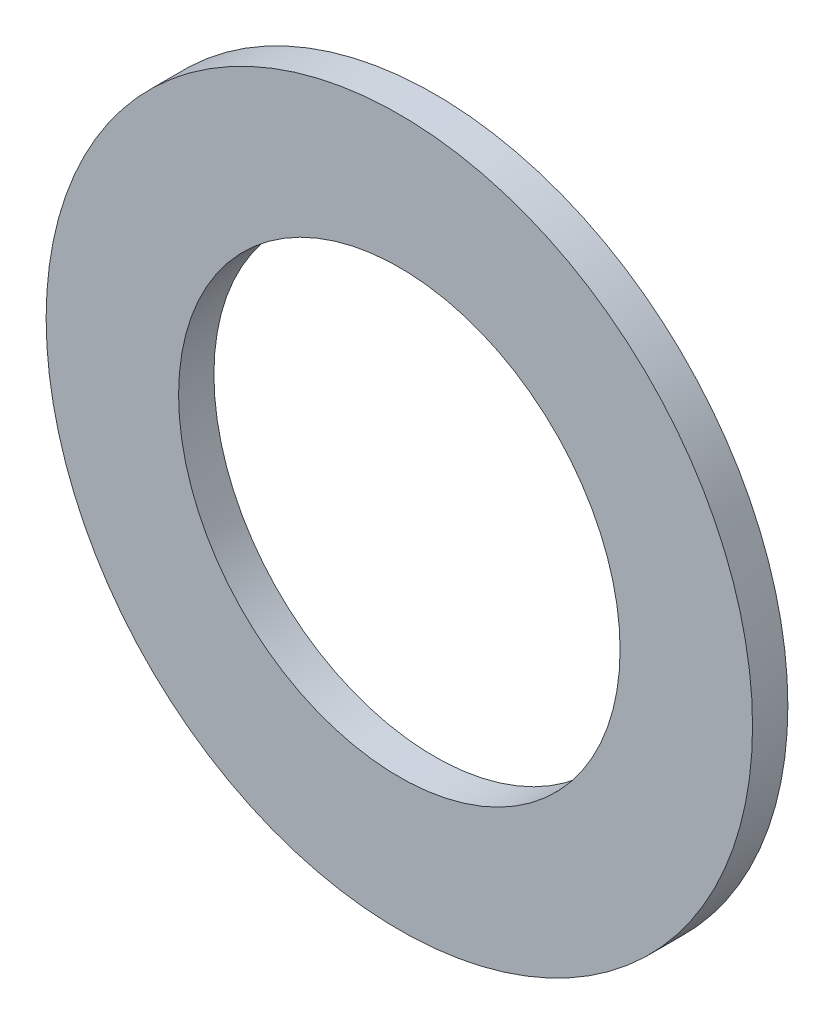
ISO-10303-21;
HEADER;
FILE_DESCRIPTION(('STEP AP214'),'2;1');
FILE_NAME('part.step','',(''),(''),'','','');
FILE_SCHEMA(('AUTOMOTIVE_DESIGN { 1 0 10303 214 1 1 1 1 }'));
ENDSEC;
DATA;
#1=APPLICATION_CONTEXT('core data for automotive mechanical design processes');
#2=APPLICATION_PROTOCOL_DEFINITION('international standard','automotive_design',2000,#1);
#3=PRODUCT_CONTEXT('',#1,'mechanical');
#4=PRODUCT('Part','Part','',(#3));
#5=PRODUCT_RELATED_PRODUCT_CATEGORY('part','',(#4));
#6=PRODUCT_DEFINITION_FORMATION('','',#4);
#7=PRODUCT_DEFINITION_CONTEXT('part definition',#1,'design');
#8=PRODUCT_DEFINITION('design','',#6,#7);
#9=PRODUCT_DEFINITION_SHAPE('','',#8);
#10=(LENGTH_UNIT() NAMED_UNIT(*) SI_UNIT(.MILLI.,.METRE.));
#11=(NAMED_UNIT(*) PLANE_ANGLE_UNIT() SI_UNIT($,.RADIAN.));
#12=(NAMED_UNIT(*) SI_UNIT($,.STERADIAN.) SOLID_ANGLE_UNIT());
#13=UNCERTAINTY_MEASURE_WITH_UNIT(LENGTH_MEASURE(1.E-05),#10,'distance_accuracy_value','');
#14=(GEOMETRIC_REPRESENTATION_CONTEXT(3) GLOBAL_UNCERTAINTY_ASSIGNED_CONTEXT((#13)) GLOBAL_UNIT_ASSIGNED_CONTEXT((#10,
#11,#12)) REPRESENTATION_CONTEXT('',''));
#15=CARTESIAN_POINT('',(0.,0.,0.));
#16=DIRECTION('',(0.,0.,1.));
#17=DIRECTION('',(1.,0.,0.));
#18=AXIS2_PLACEMENT_3D('',#15,#16,#17);
#19=CARTESIAN_POINT('',(0.,0.,2.));
#20=DIRECTION('',(0.,0.,1.));
#21=DIRECTION('',(1.,0.,0.));
#22=AXIS2_PLACEMENT_3D('',#19,#20,#21);
#23=PLANE('',#22);
#24=CARTESIAN_POINT('',(0.,0.,2.));
#25=DIRECTION('',(0.,0.,1.));
#26=DIRECTION('',(1.,0.,0.));
#27=AXIS2_PLACEMENT_3D('',#24,#25,#26);
#28=CIRCLE('',#27,20.);
#29=CARTESIAN_POINT('',(20.,0.,2.));
#30=VERTEX_POINT('',#29);
#31=EDGE_CURVE('E10',#30,#30,#28,.T.);
#32=ORIENTED_EDGE('',*,*,#31,.T.);
#33=EDGE_LOOP('',(#32));
#34=FACE_BOUND('',#33,.T.);
#35=CARTESIAN_POINT('',(0.,0.,2.));
#36=DIRECTION('',(0.,0.,1.));
#37=DIRECTION('',(1.,0.,0.));
#38=AXIS2_PLACEMENT_3D('',#35,#36,#37);
#39=CIRCLE('',#38,12.5);
#40=CARTESIAN_POINT('',(12.5,0.,2.));
#41=VERTEX_POINT('',#40);
#42=EDGE_CURVE('E50',#41,#41,#39,.T.);
#43=ORIENTED_EDGE('',*,*,#42,.F.);
#44=EDGE_LOOP('',(#43));
#45=FACE_BOUND('',#44,.T.);
#46=ADVANCED_FACE('F37',(#34,#45),#23,.T.);
#47=CARTESIAN_POINT('',(0.,0.,0.));
#48=DIRECTION('',(0.,0.,1.));
#49=DIRECTION('',(1.,0.,0.));
#50=AXIS2_PLACEMENT_3D('',#47,#48,#49);
#51=PLANE('',#50);
#52=CARTESIAN_POINT('',(0.,0.,0.));
#53=DIRECTION('',(0.,0.,1.));
#54=DIRECTION('',(1.,0.,0.));
#55=AXIS2_PLACEMENT_3D('',#52,#53,#54);
#56=CIRCLE('',#55,20.);
#57=CARTESIAN_POINT('',(20.,0.,0.));
#58=VERTEX_POINT('',#57);
#59=EDGE_CURVE('E41',#58,#58,#56,.T.);
#60=ORIENTED_EDGE('',*,*,#59,.F.);
#61=EDGE_LOOP('',(#60));
#62=FACE_BOUND('',#61,.T.);
#63=CARTESIAN_POINT('',(0.,0.,0.));
#64=DIRECTION('',(0.,0.,1.));
#65=DIRECTION('',(1.,0.,0.));
#66=AXIS2_PLACEMENT_3D('',#63,#64,#65);
#67=CIRCLE('',#66,12.5);
#68=CARTESIAN_POINT('',(12.5,0.,0.));
#69=VERTEX_POINT('',#68);
#70=EDGE_CURVE('E52',#69,#69,#67,.T.);
#71=ORIENTED_EDGE('',*,*,#70,.T.);
#72=EDGE_LOOP('',(#71));
#73=FACE_BOUND('',#72,.T.);
#74=ADVANCED_FACE('F64',(#62,#73),#51,.F.);
#75=CARTESIAN_POINT('',(0.,0.,2.));
#76=DIRECTION('',(0.,0.,-1.));
#77=DIRECTION('',(-1.,0.,0.));
#78=AXIS2_PLACEMENT_3D('',#75,#76,#77);
#79=CYLINDRICAL_SURFACE('',#78,20.);
#80=ORIENTED_EDGE('',*,*,#31,.F.);
#81=EDGE_LOOP('',(#80));
#82=FACE_BOUND('',#81,.T.);
#83=ORIENTED_EDGE('',*,*,#59,.T.);
#84=EDGE_LOOP('',(#83));
#85=FACE_BOUND('',#84,.T.);
#86=ADVANCED_FACE('F39',(#82,#85),#79,.T.);
#87=CARTESIAN_POINT('',(0.,0.,2.));
#88=DIRECTION('',(0.,0.,-1.));
#89=DIRECTION('',(-1.,0.,0.));
#90=AXIS2_PLACEMENT_3D('',#87,#88,#89);
#91=CYLINDRICAL_SURFACE('',#90,12.5);
#92=ORIENTED_EDGE('',*,*,#42,.T.);
#93=EDGE_LOOP('',(#92));
#94=FACE_BOUND('',#93,.T.);
#95=ORIENTED_EDGE('',*,*,#70,.F.);
#96=EDGE_LOOP('',(#95));
#97=FACE_BOUND('',#96,.T.);
#98=ADVANCED_FACE('F60',(#94,#97),#91,.F.);
#99=CLOSED_SHELL('',(#46,#74,#86,#98));
#100=MANIFOLD_SOLID_BREP('B2',#99);
#101=ADVANCED_BREP_SHAPE_REPRESENTATION('',(#18,#100),#14);
#102=SHAPE_DEFINITION_REPRESENTATION(#9,#101);
ENDSEC;
END-ISO-10303-21;
